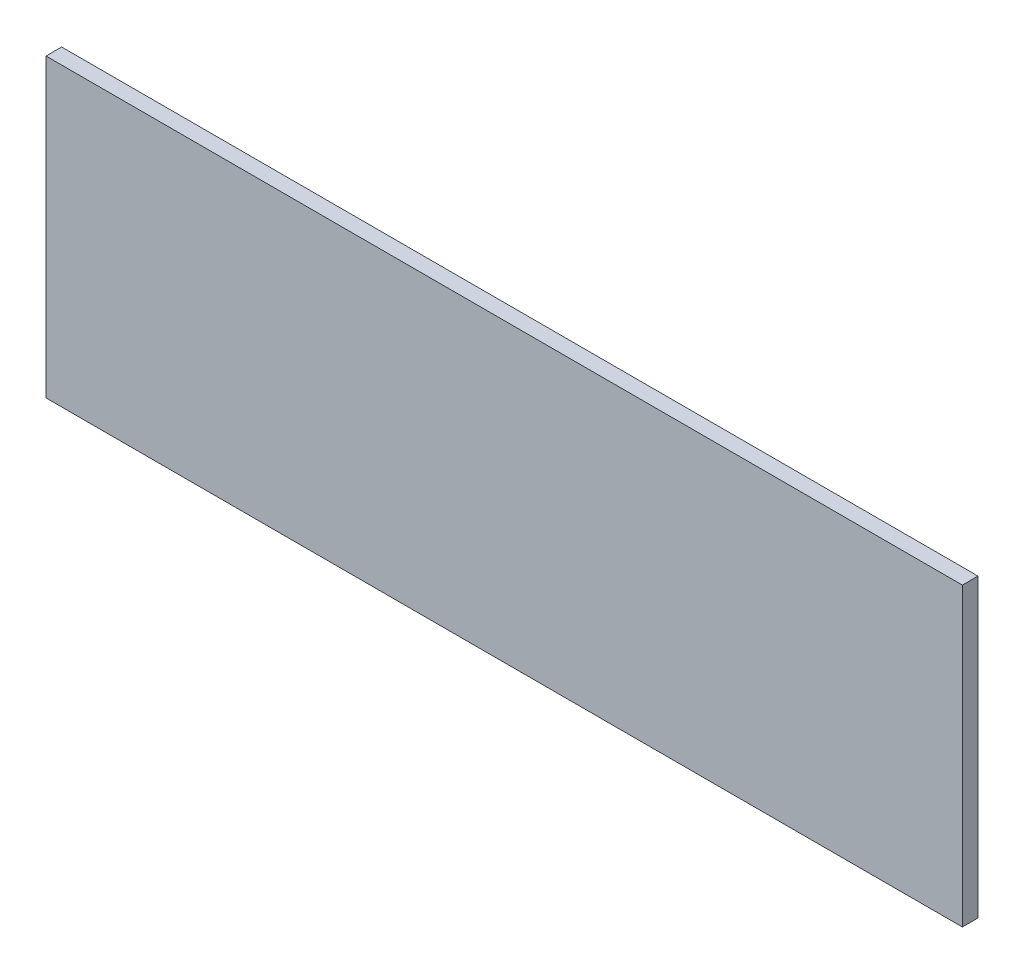
ISO-10303-21;
HEADER;
FILE_DESCRIPTION(('STEP AP214'),'2;1');
FILE_NAME('part.step','',(''),(''),'','','');
FILE_SCHEMA(('AUTOMOTIVE_DESIGN { 1 0 10303 214 1 1 1 1 }'));
ENDSEC;
DATA;
#1=APPLICATION_CONTEXT('core data for automotive mechanical design processes');
#2=APPLICATION_PROTOCOL_DEFINITION('international standard','automotive_design',2000,#1);
#3=PRODUCT_CONTEXT('',#1,'mechanical');
#4=PRODUCT('Part','Part','',(#3));
#5=PRODUCT_RELATED_PRODUCT_CATEGORY('part','',(#4));
#6=PRODUCT_DEFINITION_FORMATION('','',#4);
#7=PRODUCT_DEFINITION_CONTEXT('part definition',#1,'design');
#8=PRODUCT_DEFINITION('design','',#6,#7);
#9=PRODUCT_DEFINITION_SHAPE('','',#8);
#10=(LENGTH_UNIT() NAMED_UNIT(*) SI_UNIT(.MILLI.,.METRE.));
#11=(NAMED_UNIT(*) PLANE_ANGLE_UNIT() SI_UNIT($,.RADIAN.));
#12=(NAMED_UNIT(*) SI_UNIT($,.STERADIAN.) SOLID_ANGLE_UNIT());
#13=UNCERTAINTY_MEASURE_WITH_UNIT(LENGTH_MEASURE(1.E-05),#10,'distance_accuracy_value','');
#14=(GEOMETRIC_REPRESENTATION_CONTEXT(3) GLOBAL_UNCERTAINTY_ASSIGNED_CONTEXT((#13)) GLOBAL_UNIT_ASSIGNED_CONTEXT((#10,
#11,#12)) REPRESENTATION_CONTEXT('',''));
#15=CARTESIAN_POINT('',(0.,0.,0.));
#16=DIRECTION('',(0.,0.,1.));
#17=DIRECTION('',(1.,0.,0.));
#18=AXIS2_PLACEMENT_3D('',#15,#16,#17);
#19=CARTESIAN_POINT('',(17.018,-172.815354699861,0.761999999999985));
#20=DIRECTION('',(0.,1.,0.));
#21=DIRECTION('',(0.,0.,1.));
#22=AXIS2_PLACEMENT_3D('',#19,#20,#21);
#23=PLANE('',#22);
#24=DIRECTION('',(1.,0.,0.));
#25=VECTOR('',#24,1.);
#26=CARTESIAN_POINT('',(17.018,-172.815354699861,0.));
#27=LINE('',#26,#25);
#28=CARTESIAN_POINT('',(17.018,-172.815354699861,0.));
#29=VERTEX_POINT('',#28);
#30=CARTESIAN_POINT('',(61.722,-172.815354699861,0.));
#31=VERTEX_POINT('',#30);
#32=EDGE_CURVE('E95',#29,#31,#27,.T.);
#33=ORIENTED_EDGE('',*,*,#32,.T.);
#34=DIRECTION('',(0.,0.,-1.));
#35=VECTOR('',#34,1.);
#36=CARTESIAN_POINT('',(61.722,-172.815354699861,0.761999999999985));
#37=LINE('',#36,#35);
#38=CARTESIAN_POINT('',(61.722,-172.815354699861,0.761999999999985));
#39=VERTEX_POINT('',#38);
#40=EDGE_CURVE('E11',#39,#31,#37,.T.);
#41=ORIENTED_EDGE('',*,*,#40,.F.);
#42=DIRECTION('',(1.,0.,0.));
#43=VECTOR('',#42,1.);
#44=CARTESIAN_POINT('',(17.018,-172.815354699861,0.761999999999985));
#45=LINE('',#44,#43);
#46=CARTESIAN_POINT('',(17.018,-172.815354699861,0.761999999999985));
#47=VERTEX_POINT('',#46);
#48=EDGE_CURVE('E83',#47,#39,#45,.T.);
#49=ORIENTED_EDGE('',*,*,#48,.F.);
#50=DIRECTION('',(0.,0.,-1.));
#51=VECTOR('',#50,1.);
#52=CARTESIAN_POINT('',(17.018,-172.815354699861,0.761999999999985));
#53=LINE('',#52,#51);
#54=EDGE_CURVE('E91',#47,#29,#53,.T.);
#55=ORIENTED_EDGE('',*,*,#54,.T.);
#56=EDGE_LOOP('',(#33,#41,#49,#55));
#57=FACE_BOUND('',#56,.T.);
#58=ADVANCED_FACE('F32',(#57),#23,.F.);
#59=CARTESIAN_POINT('',(61.722,-172.815354699861,0.761999999999985));
#60=DIRECTION('',(-1.,0.,0.));
#61=DIRECTION('',(0.,0.,1.));
#62=AXIS2_PLACEMENT_3D('',#59,#60,#61);
#63=PLANE('',#62);
#64=DIRECTION('',(0.,1.,0.));
#65=VECTOR('',#64,1.);
#66=CARTESIAN_POINT('',(61.722,-172.815354699861,0.));
#67=LINE('',#66,#65);
#68=CARTESIAN_POINT('',(61.722,-158.369104699861,0.));
#69=VERTEX_POINT('',#68);
#70=EDGE_CURVE('E87',#31,#69,#67,.T.);
#71=ORIENTED_EDGE('',*,*,#70,.T.);
#72=DIRECTION('',(0.,0.,-1.));
#73=VECTOR('',#72,1.);
#74=CARTESIAN_POINT('',(61.722,-158.369104699861,0.761999999999985));
#75=LINE('',#74,#73);
#76=CARTESIAN_POINT('',(61.722,-158.369104699861,0.761999999999985));
#77=VERTEX_POINT('',#76);
#78=EDGE_CURVE('E40',#77,#69,#75,.T.);
#79=ORIENTED_EDGE('',*,*,#78,.F.);
#80=DIRECTION('',(0.,1.,0.));
#81=VECTOR('',#80,1.);
#82=CARTESIAN_POINT('',(61.722,-172.815354699861,0.761999999999985));
#83=LINE('',#82,#81);
#84=EDGE_CURVE('E78',#39,#77,#83,.T.);
#85=ORIENTED_EDGE('',*,*,#84,.F.);
#86=ORIENTED_EDGE('',*,*,#40,.T.);
#87=EDGE_LOOP('',(#71,#79,#85,#86));
#88=FACE_BOUND('',#87,.T.);
#89=ADVANCED_FACE('F86',(#88),#63,.F.);
#90=CARTESIAN_POINT('',(61.722,-158.369104699861,0.761999999999985));
#91=DIRECTION('',(0.,-1.,0.));
#92=DIRECTION('',(0.,0.,-1.));
#93=AXIS2_PLACEMENT_3D('',#90,#91,#92);
#94=PLANE('',#93);
#95=DIRECTION('',(-1.,0.,0.));
#96=VECTOR('',#95,1.);
#97=CARTESIAN_POINT('',(61.722,-158.369104699861,0.));
#98=LINE('',#97,#96);
#99=CARTESIAN_POINT('',(17.018,-158.369104699861,0.));
#100=VERTEX_POINT('',#99);
#101=EDGE_CURVE('E65',#69,#100,#98,.T.);
#102=ORIENTED_EDGE('',*,*,#101,.T.);
#103=DIRECTION('',(0.,0.,-1.));
#104=VECTOR('',#103,1.);
#105=CARTESIAN_POINT('',(17.018,-158.369104699861,0.761999999999985));
#106=LINE('',#105,#104);
#107=CARTESIAN_POINT('',(17.018,-158.369104699861,0.761999999999985));
#108=VERTEX_POINT('',#107);
#109=EDGE_CURVE('E88',#108,#100,#106,.T.);
#110=ORIENTED_EDGE('',*,*,#109,.F.);
#111=DIRECTION('',(-1.,0.,0.));
#112=VECTOR('',#111,1.);
#113=CARTESIAN_POINT('',(61.722,-158.369104699861,0.761999999999985));
#114=LINE('',#113,#112);
#115=EDGE_CURVE('E81',#77,#108,#114,.T.);
#116=ORIENTED_EDGE('',*,*,#115,.F.);
#117=ORIENTED_EDGE('',*,*,#78,.T.);
#118=EDGE_LOOP('',(#102,#110,#116,#117));
#119=FACE_BOUND('',#118,.T.);
#120=ADVANCED_FACE('F89',(#119),#94,.F.);
#121=CARTESIAN_POINT('',(17.018,-158.369104699861,0.761999999999985));
#122=DIRECTION('',(1.,0.,0.));
#123=DIRECTION('',(0.,0.,-1.));
#124=AXIS2_PLACEMENT_3D('',#121,#122,#123);
#125=PLANE('',#124);
#126=DIRECTION('',(0.,-1.,0.));
#127=VECTOR('',#126,1.);
#128=CARTESIAN_POINT('',(17.018,-158.369104699861,0.));
#129=LINE('',#128,#127);
#130=EDGE_CURVE('E71',#100,#29,#129,.T.);
#131=ORIENTED_EDGE('',*,*,#130,.T.);
#132=ORIENTED_EDGE('',*,*,#54,.F.);
#133=DIRECTION('',(0.,-1.,0.));
#134=VECTOR('',#133,1.);
#135=CARTESIAN_POINT('',(17.018,-158.369104699861,0.761999999999985));
#136=LINE('',#135,#134);
#137=EDGE_CURVE('E48',#108,#47,#136,.T.);
#138=ORIENTED_EDGE('',*,*,#137,.F.);
#139=ORIENTED_EDGE('',*,*,#109,.T.);
#140=EDGE_LOOP('',(#131,#132,#138,#139));
#141=FACE_BOUND('',#140,.T.);
#142=ADVANCED_FACE('F102',(#141),#125,.F.);
#143=CARTESIAN_POINT('',(0.,0.,0.761999999999985));
#144=DIRECTION('',(0.,0.,1.));
#145=DIRECTION('',(1.,0.,0.));
#146=AXIS2_PLACEMENT_3D('',#143,#144,#145);
#147=PLANE('',#146);
#148=ORIENTED_EDGE('',*,*,#48,.T.);
#149=ORIENTED_EDGE('',*,*,#84,.T.);
#150=ORIENTED_EDGE('',*,*,#115,.T.);
#151=ORIENTED_EDGE('',*,*,#137,.T.);
#152=EDGE_LOOP('',(#148,#149,#150,#151));
#153=FACE_BOUND('',#152,.T.);
#154=ADVANCED_FACE('F79',(#153),#147,.T.);
#155=CARTESIAN_POINT('',(0.,0.,0.));
#156=DIRECTION('',(0.,0.,1.));
#157=DIRECTION('',(1.,0.,0.));
#158=AXIS2_PLACEMENT_3D('',#155,#156,#157);
#159=PLANE('',#158);
#160=ORIENTED_EDGE('',*,*,#32,.F.);
#161=ORIENTED_EDGE('',*,*,#130,.F.);
#162=ORIENTED_EDGE('',*,*,#101,.F.);
#163=ORIENTED_EDGE('',*,*,#70,.F.);
#164=EDGE_LOOP('',(#160,#161,#162,#163));
#165=FACE_BOUND('',#164,.T.);
#166=ADVANCED_FACE('F105',(#165),#159,.F.);
#167=CLOSED_SHELL('',(#58,#89,#120,#142,#154,#166));
#168=MANIFOLD_SOLID_BREP('B2',#167);
#169=ADVANCED_BREP_SHAPE_REPRESENTATION('',(#18,#168),#14);
#170=SHAPE_DEFINITION_REPRESENTATION(#9,#169);
ENDSEC;
END-ISO-10303-21;
